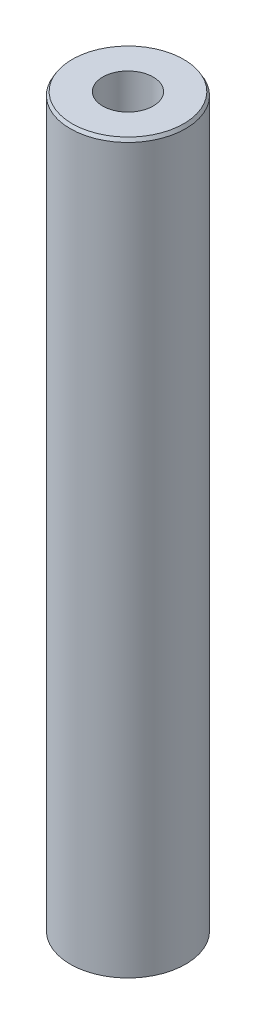
ISO-10303-21;
HEADER;
FILE_DESCRIPTION(('STEP AP214'),'2;1');
FILE_NAME('part.step','',(''),(''),'','','');
FILE_SCHEMA(('AUTOMOTIVE_DESIGN { 1 0 10303 214 1 1 1 1 }'));
ENDSEC;
DATA;
#1=APPLICATION_CONTEXT('core data for automotive mechanical design processes');
#2=APPLICATION_PROTOCOL_DEFINITION('international standard','automotive_design',2000,#1);
#3=PRODUCT_CONTEXT('',#1,'mechanical');
#4=PRODUCT('Part','Part','',(#3));
#5=PRODUCT_RELATED_PRODUCT_CATEGORY('part','',(#4));
#6=PRODUCT_DEFINITION_FORMATION('','',#4);
#7=PRODUCT_DEFINITION_CONTEXT('part definition',#1,'design');
#8=PRODUCT_DEFINITION('design','',#6,#7);
#9=PRODUCT_DEFINITION_SHAPE('','',#8);
#10=(LENGTH_UNIT() NAMED_UNIT(*) SI_UNIT(.MILLI.,.METRE.));
#11=(NAMED_UNIT(*) PLANE_ANGLE_UNIT() SI_UNIT($,.RADIAN.));
#12=(NAMED_UNIT(*) SI_UNIT($,.STERADIAN.) SOLID_ANGLE_UNIT());
#13=UNCERTAINTY_MEASURE_WITH_UNIT(LENGTH_MEASURE(1.E-05),#10,'distance_accuracy_value','');
#14=(GEOMETRIC_REPRESENTATION_CONTEXT(3) GLOBAL_UNCERTAINTY_ASSIGNED_CONTEXT((#13)) GLOBAL_UNIT_ASSIGNED_CONTEXT((#10,
#11,#12)) REPRESENTATION_CONTEXT('',''));
#15=CARTESIAN_POINT('',(0.,0.,0.));
#16=DIRECTION('',(0.,0.,1.));
#17=DIRECTION('',(1.,0.,0.));
#18=AXIS2_PLACEMENT_3D('',#15,#16,#17);
#19=CARTESIAN_POINT('',(0.,600.,0.));
#20=DIRECTION('',(0.,-1.,0.));
#21=DIRECTION('',(0.,0.,-1.));
#22=AXIS2_PLACEMENT_3D('',#19,#20,#21);
#23=CYLINDRICAL_SURFACE('',#22,47.5);
#24=CARTESIAN_POINT('',(0.,597.25304686588,0.));
#25=DIRECTION('',(0.,1.,0.));
#26=DIRECTION('',(0.,0.,1.));
#27=AXIS2_PLACEMENT_3D('',#24,#25,#26);
#28=CIRCLE('',#27,47.5);
#29=CARTESIAN_POINT('',(0.,597.25304686588,47.5));
#30=VERTEX_POINT('',#29);
#31=EDGE_CURVE('E50',#30,#30,#28,.F.);
#32=ORIENTED_EDGE('',*,*,#31,.T.);
#33=EDGE_LOOP('',(#32));
#34=FACE_BOUND('',#33,.T.);
#35=CARTESIAN_POINT('',(0.,1.58595413143536,0.));
#36=DIRECTION('',(0.,1.,0.));
#37=DIRECTION('',(0.,0.,1.));
#38=AXIS2_PLACEMENT_3D('',#35,#36,#37);
#39=CIRCLE('',#38,47.5);
#40=CARTESIAN_POINT('',(0.,1.58595413143536,47.5));
#41=VERTEX_POINT('',#40);
#42=EDGE_CURVE('E51',#41,#41,#39,.T.);
#43=ORIENTED_EDGE('',*,*,#42,.T.);
#44=EDGE_LOOP('',(#43));
#45=FACE_BOUND('',#44,.T.);
#46=ADVANCED_FACE('F39',(#34,#45),#23,.T.);
#47=CARTESIAN_POINT('',(0.,600.,0.));
#48=DIRECTION('',(0.,1.,0.));
#49=DIRECTION('',(0.,0.,1.));
#50=AXIS2_PLACEMENT_3D('',#47,#48,#49);
#51=PLANE('',#50);
#52=CARTESIAN_POINT('',(0.,600.,0.));
#53=DIRECTION('',(0.,1.,0.));
#54=DIRECTION('',(0.,0.,1.));
#55=AXIS2_PLACEMENT_3D('',#52,#53,#54);
#56=CIRCLE('',#55,45.9140458685647);
#57=CARTESIAN_POINT('',(0.,600.,45.9140458685647));
#58=VERTEX_POINT('',#57);
#59=EDGE_CURVE('E54',#58,#58,#56,.T.);
#60=ORIENTED_EDGE('',*,*,#59,.T.);
#61=EDGE_LOOP('',(#60));
#62=FACE_BOUND('',#61,.T.);
#63=CARTESIAN_POINT('',(0.,600.,0.));
#64=DIRECTION('',(0.,1.,0.));
#65=DIRECTION('',(0.,0.,1.));
#66=AXIS2_PLACEMENT_3D('',#63,#64,#65);
#67=CIRCLE('',#66,20.7554126473668);
#68=CARTESIAN_POINT('',(0.,600.,20.7554126473668));
#69=VERTEX_POINT('',#68);
#70=EDGE_CURVE('E58',#69,#69,#67,.T.);
#71=ORIENTED_EDGE('',*,*,#70,.F.);
#72=EDGE_LOOP('',(#71));
#73=FACE_BOUND('',#72,.T.);
#74=ADVANCED_FACE('F69',(#62,#73),#51,.T.);
#75=CARTESIAN_POINT('',(0.,0.,0.));
#76=DIRECTION('',(0.,1.,0.));
#77=DIRECTION('',(0.,0.,1.));
#78=AXIS2_PLACEMENT_3D('',#75,#76,#77);
#79=PLANE('',#78);
#80=CARTESIAN_POINT('',(0.,0.,0.));
#81=DIRECTION('',(0.,1.,0.));
#82=DIRECTION('',(0.,0.,1.));
#83=AXIS2_PLACEMENT_3D('',#80,#81,#82);
#84=CIRCLE('',#83,44.7530468658803);
#85=CARTESIAN_POINT('',(0.,0.,44.7530468658803));
#86=VERTEX_POINT('',#85);
#87=EDGE_CURVE('E10',#86,#86,#84,.F.);
#88=ORIENTED_EDGE('',*,*,#87,.T.);
#89=EDGE_LOOP('',(#88));
#90=FACE_BOUND('',#89,.T.);
#91=CARTESIAN_POINT('',(0.,0.,0.));
#92=DIRECTION('',(0.,1.,0.));
#93=DIRECTION('',(0.,0.,1.));
#94=AXIS2_PLACEMENT_3D('',#91,#92,#93);
#95=CIRCLE('',#94,20.7554126473668);
#96=CARTESIAN_POINT('',(0.,0.,20.7554126473668));
#97=VERTEX_POINT('',#96);
#98=EDGE_CURVE('E63',#97,#97,#95,.T.);
#99=ORIENTED_EDGE('',*,*,#98,.T.);
#100=EDGE_LOOP('',(#99));
#101=FACE_BOUND('',#100,.T.);
#102=ADVANCED_FACE('F75',(#90,#101),#79,.F.);
#103=CARTESIAN_POINT('',(0.,600.,0.));
#104=DIRECTION('',(0.,-1.,0.));
#105=DIRECTION('',(0.,0.,-1.));
#106=AXIS2_PLACEMENT_3D('',#103,#104,#105);
#107=CYLINDRICAL_SURFACE('',#106,20.7554126473668);
#108=ORIENTED_EDGE('',*,*,#70,.T.);
#109=EDGE_LOOP('',(#108));
#110=FACE_BOUND('',#109,.T.);
#111=ORIENTED_EDGE('',*,*,#98,.F.);
#112=EDGE_LOOP('',(#111));
#113=FACE_BOUND('',#112,.T.);
#114=ADVANCED_FACE('F70',(#110,#113),#107,.F.);
#115=CARTESIAN_POINT('',(0.,600.,0.));
#116=DIRECTION('',(0.,-1.,0.));
#117=DIRECTION('',(0.,0.,-1.));
#118=AXIS2_PLACEMENT_3D('',#115,#116,#117);
#119=CONICAL_SURFACE('',#118,45.9140458685647,0.523598775598282);
#120=ORIENTED_EDGE('',*,*,#31,.F.);
#121=EDGE_LOOP('',(#120));
#122=FACE_BOUND('',#121,.T.);
#123=ORIENTED_EDGE('',*,*,#59,.F.);
#124=EDGE_LOOP('',(#123));
#125=FACE_BOUND('',#124,.T.);
#126=ADVANCED_FACE('F81',(#122,#125),#119,.T.);
#127=CARTESIAN_POINT('',(0.,1.58595413143536,0.));
#128=DIRECTION('',(0.,1.,0.));
#129=DIRECTION('',(0.,0.,1.));
#130=AXIS2_PLACEMENT_3D('',#127,#128,#129);
#131=CONICAL_SURFACE('',#130,47.5,1.04719755119658);
#132=ORIENTED_EDGE('',*,*,#87,.F.);
#133=EDGE_LOOP('',(#132));
#134=FACE_BOUND('',#133,.T.);
#135=ORIENTED_EDGE('',*,*,#42,.F.);
#136=EDGE_LOOP('',(#135));
#137=FACE_BOUND('',#136,.T.);
#138=ADVANCED_FACE('F45',(#134,#137),#131,.T.);
#139=CLOSED_SHELL('',(#46,#74,#102,#114,#126,#138));
#140=MANIFOLD_SOLID_BREP('B2',#139);
#141=ADVANCED_BREP_SHAPE_REPRESENTATION('',(#18,#140),#14);
#142=SHAPE_DEFINITION_REPRESENTATION(#9,#141);
ENDSEC;
END-ISO-10303-21;
